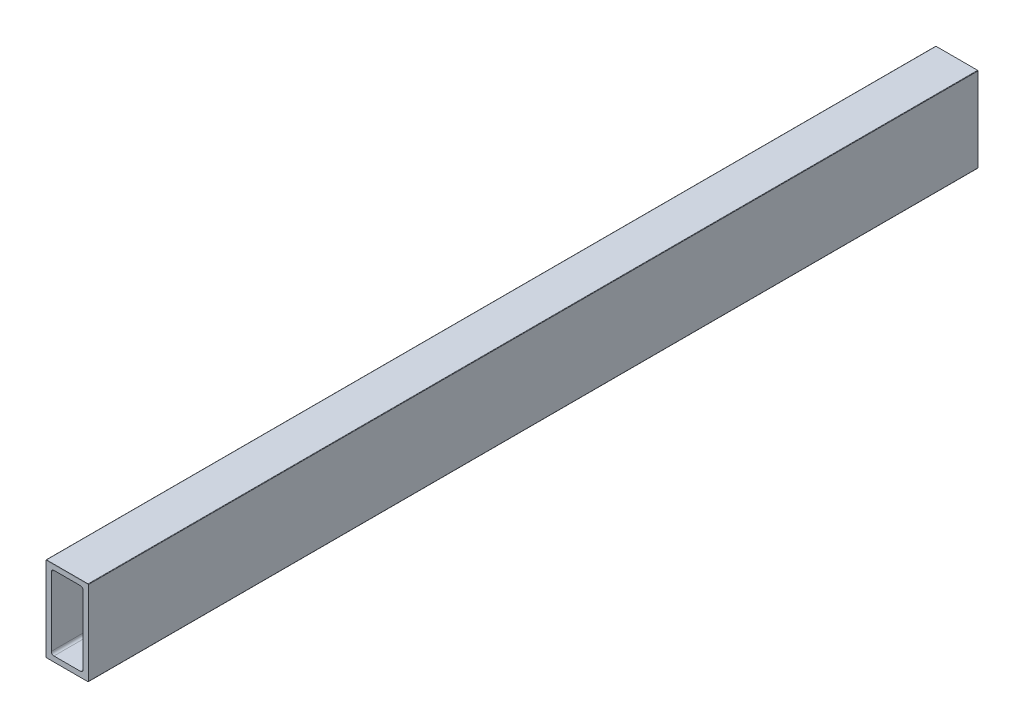
ISO-10303-21;
HEADER;
FILE_DESCRIPTION(('STEP AP214'),'2;1');
FILE_NAME('part.step','',(''),(''),'','','');
FILE_SCHEMA(('AUTOMOTIVE_DESIGN { 1 0 10303 214 1 1 1 1 }'));
ENDSEC;
DATA;
#1=APPLICATION_CONTEXT('core data for automotive mechanical design processes');
#2=APPLICATION_PROTOCOL_DEFINITION('international standard','automotive_design',2000,#1);
#3=PRODUCT_CONTEXT('',#1,'mechanical');
#4=PRODUCT('Part','Part','',(#3));
#5=PRODUCT_RELATED_PRODUCT_CATEGORY('part','',(#4));
#6=PRODUCT_DEFINITION_FORMATION('','',#4);
#7=PRODUCT_DEFINITION_CONTEXT('part definition',#1,'design');
#8=PRODUCT_DEFINITION('design','',#6,#7);
#9=PRODUCT_DEFINITION_SHAPE('','',#8);
#10=(LENGTH_UNIT() NAMED_UNIT(*) SI_UNIT(.MILLI.,.METRE.));
#11=(NAMED_UNIT(*) PLANE_ANGLE_UNIT() SI_UNIT($,.RADIAN.));
#12=(NAMED_UNIT(*) SI_UNIT($,.STERADIAN.) SOLID_ANGLE_UNIT());
#13=UNCERTAINTY_MEASURE_WITH_UNIT(LENGTH_MEASURE(1.E-05),#10,'distance_accuracy_value','');
#14=(GEOMETRIC_REPRESENTATION_CONTEXT(3) GLOBAL_UNCERTAINTY_ASSIGNED_CONTEXT((#13)) GLOBAL_UNIT_ASSIGNED_CONTEXT((#10,
#11,#12)) REPRESENTATION_CONTEXT('',''));
#15=CARTESIAN_POINT('',(0.,0.,0.));
#16=DIRECTION('',(0.,0.,1.));
#17=DIRECTION('',(1.,0.,0.));
#18=AXIS2_PLACEMENT_3D('',#15,#16,#17);
#19=CARTESIAN_POINT('',(3.175,4.7625,1828.8));
#20=DIRECTION('',(1.,0.,0.));
#21=DIRECTION('',(0.,1.,0.));
#22=AXIS2_PLACEMENT_3D('',#19,#20,#21);
#23=PLANE('',#22);
#24=DIRECTION('',(0.,1.,0.));
#25=VECTOR('',#24,1.);
#26=CARTESIAN_POINT('',(3.175,4.7625,533.4));
#27=LINE('',#26,#25);
#28=CARTESIAN_POINT('',(3.175,4.7625,533.4));
#29=VERTEX_POINT('',#28);
#30=CARTESIAN_POINT('',(3.175,46.0375,533.4));
#31=VERTEX_POINT('',#30);
#32=EDGE_CURVE('E306',#29,#31,#27,.T.);
#33=ORIENTED_EDGE('',*,*,#32,.F.);
#34=DIRECTION('',(0.,0.,-1.));
#35=VECTOR('',#34,1.);
#36=CARTESIAN_POINT('',(3.175,4.7625,1828.8));
#37=LINE('',#36,#35);
#38=CARTESIAN_POINT('',(3.175,4.7625,0.));
#39=VERTEX_POINT('',#38);
#40=EDGE_CURVE('E200',#29,#39,#37,.T.);
#41=ORIENTED_EDGE('',*,*,#40,.T.);
#42=DIRECTION('',(0.,-1.,0.));
#43=VECTOR('',#42,1.);
#44=CARTESIAN_POINT('',(3.175,4.7625,0.));
#45=LINE('',#44,#43);
#46=CARTESIAN_POINT('',(3.175,46.0375,0.));
#47=VERTEX_POINT('',#46);
#48=EDGE_CURVE('E226',#47,#39,#45,.T.);
#49=ORIENTED_EDGE('',*,*,#48,.F.);
#50=DIRECTION('',(0.,0.,-1.));
#51=VECTOR('',#50,1.);
#52=CARTESIAN_POINT('',(3.175,46.0375,1828.8));
#53=LINE('',#52,#51);
#54=EDGE_CURVE('E271',#31,#47,#53,.T.);
#55=ORIENTED_EDGE('',*,*,#54,.F.);
#56=EDGE_LOOP('',(#33,#41,#49,#55));
#57=FACE_BOUND('',#56,.T.);
#58=ADVANCED_FACE('F44',(#57),#23,.T.);
#59=CARTESIAN_POINT('',(4.7625,46.0375,1828.8));
#60=DIRECTION('',(0.,0.,-1.));
#61=DIRECTION('',(-1.,0.,0.));
#62=AXIS2_PLACEMENT_3D('',#59,#60,#61);
#63=CYLINDRICAL_SURFACE('',#62,1.5875);
#64=DIRECTION('',(0.,0.,-1.));
#65=VECTOR('',#64,1.);
#66=CARTESIAN_POINT('',(4.7625,47.625,1828.8));
#67=LINE('',#66,#65);
#68=CARTESIAN_POINT('',(4.7625,47.625,533.4));
#69=VERTEX_POINT('',#68);
#70=CARTESIAN_POINT('',(4.7625,47.625,0.));
#71=VERTEX_POINT('',#70);
#72=EDGE_CURVE('E248',#69,#71,#67,.T.);
#73=ORIENTED_EDGE('',*,*,#72,.F.);
#74=CARTESIAN_POINT('',(4.7625,46.0375,533.4));
#75=DIRECTION('',(0.,0.,-1.));
#76=DIRECTION('',(-1.,0.,0.));
#77=AXIS2_PLACEMENT_3D('',#74,#75,#76);
#78=CIRCLE('',#77,1.5875);
#79=EDGE_CURVE('E308',#69,#31,#78,.F.);
#80=ORIENTED_EDGE('',*,*,#79,.T.);
#81=ORIENTED_EDGE('',*,*,#54,.T.);
#82=CARTESIAN_POINT('',(4.7625,46.0375,0.));
#83=DIRECTION('',(0.,0.,1.));
#84=DIRECTION('',(-1.,0.,0.));
#85=AXIS2_PLACEMENT_3D('',#82,#83,#84);
#86=CIRCLE('',#85,1.5875);
#87=EDGE_CURVE('E266',#71,#47,#86,.T.);
#88=ORIENTED_EDGE('',*,*,#87,.F.);
#89=EDGE_LOOP('',(#73,#80,#81,#88));
#90=FACE_BOUND('',#89,.T.);
#91=ADVANCED_FACE('F465',(#90),#63,.F.);
#92=CARTESIAN_POINT('',(4.7625,47.625,1828.8));
#93=DIRECTION('',(0.,-1.,0.));
#94=DIRECTION('',(0.,0.,-1.));
#95=AXIS2_PLACEMENT_3D('',#92,#93,#94);
#96=PLANE('',#95);
#97=DIRECTION('',(1.,0.,0.));
#98=VECTOR('',#97,1.);
#99=CARTESIAN_POINT('',(4.7625,47.625,533.4));
#100=LINE('',#99,#98);
#101=CARTESIAN_POINT('',(20.6375,47.625,533.4));
#102=VERTEX_POINT('',#101);
#103=EDGE_CURVE('E311',#69,#102,#100,.T.);
#104=ORIENTED_EDGE('',*,*,#103,.F.);
#105=ORIENTED_EDGE('',*,*,#72,.T.);
#106=DIRECTION('',(-1.,0.,0.));
#107=VECTOR('',#106,1.);
#108=CARTESIAN_POINT('',(4.7625,47.625,0.));
#109=LINE('',#108,#107);
#110=CARTESIAN_POINT('',(20.6375,47.625,0.));
#111=VERTEX_POINT('',#110);
#112=EDGE_CURVE('E255',#111,#71,#109,.T.);
#113=ORIENTED_EDGE('',*,*,#112,.F.);
#114=DIRECTION('',(0.,0.,-1.));
#115=VECTOR('',#114,1.);
#116=CARTESIAN_POINT('',(20.6375,47.625,1828.8));
#117=LINE('',#116,#115);
#118=EDGE_CURVE('E246',#102,#111,#117,.T.);
#119=ORIENTED_EDGE('',*,*,#118,.F.);
#120=EDGE_LOOP('',(#104,#105,#113,#119));
#121=FACE_BOUND('',#120,.T.);
#122=ADVANCED_FACE('F390',(#121),#96,.T.);
#123=CARTESIAN_POINT('',(20.6375,46.0375,1828.8));
#124=DIRECTION('',(0.,0.,-1.));
#125=DIRECTION('',(-1.,0.,0.));
#126=AXIS2_PLACEMENT_3D('',#123,#124,#125);
#127=CYLINDRICAL_SURFACE('',#126,1.5875);
#128=DIRECTION('',(0.,0.,-1.));
#129=VECTOR('',#128,1.);
#130=CARTESIAN_POINT('',(22.225,46.0375,1828.8));
#131=LINE('',#130,#129);
#132=CARTESIAN_POINT('',(22.225,46.0375,533.4));
#133=VERTEX_POINT('',#132);
#134=CARTESIAN_POINT('',(22.225,46.0375,0.));
#135=VERTEX_POINT('',#134);
#136=EDGE_CURVE('E212',#133,#135,#131,.T.);
#137=ORIENTED_EDGE('',*,*,#136,.F.);
#138=CARTESIAN_POINT('',(20.6375,46.0375,533.4));
#139=DIRECTION('',(0.,0.,-1.));
#140=DIRECTION('',(-1.,0.,0.));
#141=AXIS2_PLACEMENT_3D('',#138,#139,#140);
#142=CIRCLE('',#141,1.5875);
#143=EDGE_CURVE('E313',#133,#102,#142,.F.);
#144=ORIENTED_EDGE('',*,*,#143,.T.);
#145=ORIENTED_EDGE('',*,*,#118,.T.);
#146=CARTESIAN_POINT('',(20.6375,46.0375,0.));
#147=DIRECTION('',(0.,0.,1.));
#148=DIRECTION('',(-1.,0.,0.));
#149=AXIS2_PLACEMENT_3D('',#146,#147,#148);
#150=CIRCLE('',#149,1.5875);
#151=EDGE_CURVE('E224',#135,#111,#150,.T.);
#152=ORIENTED_EDGE('',*,*,#151,.F.);
#153=EDGE_LOOP('',(#137,#144,#145,#152));
#154=FACE_BOUND('',#153,.T.);
#155=ADVANCED_FACE('F385',(#154),#127,.F.);
#156=CARTESIAN_POINT('',(22.225,4.7625,1828.8));
#157=DIRECTION('',(-1.,0.,0.));
#158=DIRECTION('',(0.,0.,1.));
#159=AXIS2_PLACEMENT_3D('',#156,#157,#158);
#160=PLANE('',#159);
#161=DIRECTION('',(0.,-1.,0.));
#162=VECTOR('',#161,1.);
#163=CARTESIAN_POINT('',(22.225,4.7625,533.4));
#164=LINE('',#163,#162);
#165=CARTESIAN_POINT('',(22.225,4.7625,533.4));
#166=VERTEX_POINT('',#165);
#167=EDGE_CURVE('E316',#133,#166,#164,.T.);
#168=ORIENTED_EDGE('',*,*,#167,.F.);
#169=ORIENTED_EDGE('',*,*,#136,.T.);
#170=DIRECTION('',(0.,1.,0.));
#171=VECTOR('',#170,1.);
#172=CARTESIAN_POINT('',(22.225,4.7625,0.));
#173=LINE('',#172,#171);
#174=CARTESIAN_POINT('',(22.225,4.7625,0.));
#175=VERTEX_POINT('',#174);
#176=EDGE_CURVE('E220',#175,#135,#173,.T.);
#177=ORIENTED_EDGE('',*,*,#176,.F.);
#178=DIRECTION('',(0.,0.,-1.));
#179=VECTOR('',#178,1.);
#180=CARTESIAN_POINT('',(22.225,4.7625,1828.8));
#181=LINE('',#180,#179);
#182=EDGE_CURVE('E210',#166,#175,#181,.T.);
#183=ORIENTED_EDGE('',*,*,#182,.F.);
#184=EDGE_LOOP('',(#168,#169,#177,#183));
#185=FACE_BOUND('',#184,.T.);
#186=ADVANCED_FACE('F361',(#185),#160,.T.);
#187=CARTESIAN_POINT('',(20.6375,4.7625,1828.8));
#188=DIRECTION('',(0.,0.,-1.));
#189=DIRECTION('',(-1.,0.,0.));
#190=AXIS2_PLACEMENT_3D('',#187,#188,#189);
#191=CYLINDRICAL_SURFACE('',#190,1.5875);
#192=DIRECTION('',(0.,0.,-1.));
#193=VECTOR('',#192,1.);
#194=CARTESIAN_POINT('',(20.6375,3.175,1828.8));
#195=LINE('',#194,#193);
#196=CARTESIAN_POINT('',(20.6375,3.175,533.4));
#197=VERTEX_POINT('',#196);
#198=CARTESIAN_POINT('',(20.6375,3.175,0.));
#199=VERTEX_POINT('',#198);
#200=EDGE_CURVE('E213',#197,#199,#195,.T.);
#201=ORIENTED_EDGE('',*,*,#200,.F.);
#202=CARTESIAN_POINT('',(20.6375,4.7625,533.4));
#203=DIRECTION('',(0.,0.,-1.));
#204=DIRECTION('',(-1.,0.,0.));
#205=AXIS2_PLACEMENT_3D('',#202,#203,#204);
#206=CIRCLE('',#205,1.5875);
#207=EDGE_CURVE('E318',#197,#166,#206,.F.);
#208=ORIENTED_EDGE('',*,*,#207,.T.);
#209=ORIENTED_EDGE('',*,*,#182,.T.);
#210=CARTESIAN_POINT('',(20.6375,4.7625,0.));
#211=DIRECTION('',(0.,0.,1.));
#212=DIRECTION('',(-1.,0.,0.));
#213=AXIS2_PLACEMENT_3D('',#210,#211,#212);
#214=CIRCLE('',#213,1.5875);
#215=EDGE_CURVE('E225',#199,#175,#214,.T.);
#216=ORIENTED_EDGE('',*,*,#215,.F.);
#217=EDGE_LOOP('',(#201,#208,#209,#216));
#218=FACE_BOUND('',#217,.T.);
#219=ADVANCED_FACE('F355',(#218),#191,.F.);
#220=CARTESIAN_POINT('',(4.7625,3.175,1828.8));
#221=DIRECTION('',(0.,1.,0.));
#222=DIRECTION('',(1.,0.,0.));
#223=AXIS2_PLACEMENT_3D('',#220,#221,#222);
#224=PLANE('',#223);
#225=DIRECTION('',(-1.,0.,0.));
#226=VECTOR('',#225,1.);
#227=CARTESIAN_POINT('',(4.7625,3.175,533.4));
#228=LINE('',#227,#226);
#229=CARTESIAN_POINT('',(4.7625,3.175,533.4));
#230=VERTEX_POINT('',#229);
#231=EDGE_CURVE('E59',#197,#230,#228,.T.);
#232=ORIENTED_EDGE('',*,*,#231,.F.);
#233=ORIENTED_EDGE('',*,*,#200,.T.);
#234=DIRECTION('',(1.,0.,0.));
#235=VECTOR('',#234,1.);
#236=CARTESIAN_POINT('',(4.7625,3.175,0.));
#237=LINE('',#236,#235);
#238=CARTESIAN_POINT('',(4.7625,3.175,0.));
#239=VERTEX_POINT('',#238);
#240=EDGE_CURVE('E262',#239,#199,#237,.T.);
#241=ORIENTED_EDGE('',*,*,#240,.F.);
#242=DIRECTION('',(0.,0.,-1.));
#243=VECTOR('',#242,1.);
#244=CARTESIAN_POINT('',(4.7625,3.175,1828.8));
#245=LINE('',#244,#243);
#246=EDGE_CURVE('E203',#230,#239,#245,.T.);
#247=ORIENTED_EDGE('',*,*,#246,.F.);
#248=EDGE_LOOP('',(#232,#233,#241,#247));
#249=FACE_BOUND('',#248,.T.);
#250=ADVANCED_FACE('F360',(#249),#224,.T.);
#251=CARTESIAN_POINT('',(4.7625,4.7625,1828.8));
#252=DIRECTION('',(0.,0.,-1.));
#253=DIRECTION('',(-1.,0.,0.));
#254=AXIS2_PLACEMENT_3D('',#251,#252,#253);
#255=CYLINDRICAL_SURFACE('',#254,1.5875);
#256=ORIENTED_EDGE('',*,*,#40,.F.);
#257=CARTESIAN_POINT('',(4.7625,4.7625,533.4));
#258=DIRECTION('',(0.,0.,-1.));
#259=DIRECTION('',(-1.,0.,0.));
#260=AXIS2_PLACEMENT_3D('',#257,#258,#259);
#261=CIRCLE('',#260,1.5875);
#262=EDGE_CURVE('E322',#29,#230,#261,.F.);
#263=ORIENTED_EDGE('',*,*,#262,.T.);
#264=ORIENTED_EDGE('',*,*,#246,.T.);
#265=CARTESIAN_POINT('',(4.7625,4.7625,0.));
#266=DIRECTION('',(0.,0.,1.));
#267=DIRECTION('',(1.,0.,0.));
#268=AXIS2_PLACEMENT_3D('',#265,#266,#267);
#269=CIRCLE('',#268,1.5875);
#270=EDGE_CURVE('E230',#39,#239,#269,.T.);
#271=ORIENTED_EDGE('',*,*,#270,.F.);
#272=EDGE_LOOP('',(#256,#263,#264,#271));
#273=FACE_BOUND('',#272,.T.);
#274=ADVANCED_FACE('F431',(#273),#255,.F.);
#275=CARTESIAN_POINT('',(0.,0.254,1828.8));
#276=DIRECTION('',(1.,0.,0.));
#277=DIRECTION('',(0.,1.,0.));
#278=AXIS2_PLACEMENT_3D('',#275,#276,#277);
#279=PLANE('',#278);
#280=DIRECTION('',(0.,0.,-1.));
#281=VECTOR('',#280,1.);
#282=CARTESIAN_POINT('',(0.,0.254,1828.8));
#283=LINE('',#282,#281);
#284=CARTESIAN_POINT('',(0.,0.254,533.4));
#285=VERTEX_POINT('',#284);
#286=CARTESIAN_POINT('',(0.,0.254,0.));
#287=VERTEX_POINT('',#286);
#288=EDGE_CURVE('E194',#285,#287,#283,.T.);
#289=ORIENTED_EDGE('',*,*,#288,.F.);
#290=DIRECTION('',(0.,-1.,0.));
#291=VECTOR('',#290,1.);
#292=CARTESIAN_POINT('',(0.,-78.7444375081889,533.4));
#293=LINE('',#292,#291);
#294=CARTESIAN_POINT('',(0.,50.546,533.4));
#295=VERTEX_POINT('',#294);
#296=EDGE_CURVE('E67',#295,#285,#293,.T.);
#297=ORIENTED_EDGE('',*,*,#296,.F.);
#298=DIRECTION('',(0.,0.,-1.));
#299=VECTOR('',#298,1.);
#300=CARTESIAN_POINT('',(0.,50.546,1828.8));
#301=LINE('',#300,#299);
#302=CARTESIAN_POINT('',(0.,50.546,0.));
#303=VERTEX_POINT('',#302);
#304=EDGE_CURVE('E192',#295,#303,#301,.T.);
#305=ORIENTED_EDGE('',*,*,#304,.T.);
#306=DIRECTION('',(0.,-1.,0.));
#307=VECTOR('',#306,1.);
#308=CARTESIAN_POINT('',(0.,0.254,0.));
#309=LINE('',#308,#307);
#310=EDGE_CURVE('E256',#303,#287,#309,.T.);
#311=ORIENTED_EDGE('',*,*,#310,.T.);
#312=EDGE_LOOP('',(#289,#297,#305,#311));
#313=FACE_BOUND('',#312,.T.);
#314=ADVANCED_FACE('F46',(#313),#279,.F.);
#315=CARTESIAN_POINT('',(0.254,50.546,1828.8));
#316=DIRECTION('',(0.,0.,-1.));
#317=DIRECTION('',(-1.,0.,0.));
#318=AXIS2_PLACEMENT_3D('',#315,#316,#317);
#319=CYLINDRICAL_SURFACE('',#318,0.253999999999995);
#320=CARTESIAN_POINT('',(0.254,50.546,533.4));
#321=DIRECTION('',(0.,-0.160026046570858,-0.987112792146319));
#322=DIRECTION('',(0.,0.987112792146319,-0.160026046570858));
#323=AXIS2_PLACEMENT_3D('',#320,#321,#322);
#324=ELLIPSE('',#323,0.257316085882863,0.253999999999995);
#325=CARTESIAN_POINT('',(0.254,50.8,533.358822724057));
#326=VERTEX_POINT('',#325);
#327=EDGE_CURVE('E173',#326,#295,#324,.F.);
#328=ORIENTED_EDGE('',*,*,#327,.F.);
#329=DIRECTION('',(0.,0.,-1.));
#330=VECTOR('',#329,1.);
#331=CARTESIAN_POINT('',(0.254,50.8,1828.8));
#332=LINE('',#331,#330);
#333=CARTESIAN_POINT('',(0.254,50.8,0.));
#334=VERTEX_POINT('',#333);
#335=EDGE_CURVE('E201',#326,#334,#332,.T.);
#336=ORIENTED_EDGE('',*,*,#335,.T.);
#337=CARTESIAN_POINT('',(0.254,50.546,0.));
#338=DIRECTION('',(0.,0.,1.));
#339=DIRECTION('',(-1.,0.,0.));
#340=AXIS2_PLACEMENT_3D('',#337,#338,#339);
#341=CIRCLE('',#340,0.253999999999995);
#342=EDGE_CURVE('E198',#334,#303,#341,.T.);
#343=ORIENTED_EDGE('',*,*,#342,.T.);
#344=ORIENTED_EDGE('',*,*,#304,.F.);
#345=EDGE_LOOP('',(#328,#336,#343,#344));
#346=FACE_BOUND('',#345,.T.);
#347=ADVANCED_FACE('F196',(#346),#319,.T.);
#348=CARTESIAN_POINT('',(0.254,50.8,1828.8));
#349=DIRECTION('',(0.,-1.,0.));
#350=DIRECTION('',(0.,0.,-1.));
#351=AXIS2_PLACEMENT_3D('',#348,#349,#350);
#352=PLANE('',#351);
#353=ORIENTED_EDGE('',*,*,#335,.F.);
#354=DIRECTION('',(1.,0.,0.));
#355=VECTOR('',#354,1.);
#356=CARTESIAN_POINT('',(0.254,50.8,533.358822724057));
#357=LINE('',#356,#355);
#358=CARTESIAN_POINT('',(25.146,50.8,533.358822724057));
#359=VERTEX_POINT('',#358);
#360=EDGE_CURVE('E178',#326,#359,#357,.T.);
#361=ORIENTED_EDGE('',*,*,#360,.T.);
#362=DIRECTION('',(0.,0.,-1.));
#363=VECTOR('',#362,1.);
#364=CARTESIAN_POINT('',(25.146,50.8,1828.8));
#365=LINE('',#364,#363);
#366=CARTESIAN_POINT('',(25.146,50.8,0.));
#367=VERTEX_POINT('',#366);
#368=EDGE_CURVE('E205',#359,#367,#365,.T.);
#369=ORIENTED_EDGE('',*,*,#368,.T.);
#370=DIRECTION('',(-1.,0.,0.));
#371=VECTOR('',#370,1.);
#372=CARTESIAN_POINT('',(0.254,50.8,0.));
#373=LINE('',#372,#371);
#374=EDGE_CURVE('E231',#367,#334,#373,.T.);
#375=ORIENTED_EDGE('',*,*,#374,.T.);
#376=EDGE_LOOP('',(#353,#361,#369,#375));
#377=FACE_BOUND('',#376,.T.);
#378=ADVANCED_FACE('F340',(#377),#352,.F.);
#379=CARTESIAN_POINT('',(25.146,50.546,1828.8));
#380=DIRECTION('',(0.,0.,-1.));
#381=DIRECTION('',(-1.,0.,0.));
#382=AXIS2_PLACEMENT_3D('',#379,#380,#381);
#383=CYLINDRICAL_SURFACE('',#382,0.253999999999994);
#384=CARTESIAN_POINT('',(25.146,50.546,533.4));
#385=DIRECTION('',(0.,-0.160026046570858,-0.987112792146319));
#386=DIRECTION('',(0.,0.987112792146319,-0.160026046570858));
#387=AXIS2_PLACEMENT_3D('',#384,#385,#386);
#388=ELLIPSE('',#387,0.257316085882862,0.253999999999994);
#389=CARTESIAN_POINT('',(25.4,50.546,533.4));
#390=VERTEX_POINT('',#389);
#391=EDGE_CURVE('E11',#390,#359,#388,.F.);
#392=ORIENTED_EDGE('',*,*,#391,.F.);
#393=DIRECTION('',(0.,0.,-1.));
#394=VECTOR('',#393,1.);
#395=CARTESIAN_POINT('',(25.4,50.546,1828.8));
#396=LINE('',#395,#394);
#397=CARTESIAN_POINT('',(25.4,50.546,0.));
#398=VERTEX_POINT('',#397);
#399=EDGE_CURVE('E244',#390,#398,#396,.T.);
#400=ORIENTED_EDGE('',*,*,#399,.T.);
#401=CARTESIAN_POINT('',(25.146,50.546,0.));
#402=DIRECTION('',(0.,0.,1.));
#403=DIRECTION('',(-1.,0.,0.));
#404=AXIS2_PLACEMENT_3D('',#401,#402,#403);
#405=CIRCLE('',#404,0.253999999999994);
#406=EDGE_CURVE('E234',#398,#367,#405,.T.);
#407=ORIENTED_EDGE('',*,*,#406,.T.);
#408=ORIENTED_EDGE('',*,*,#368,.F.);
#409=EDGE_LOOP('',(#392,#400,#407,#408));
#410=FACE_BOUND('',#409,.T.);
#411=ADVANCED_FACE('F338',(#410),#383,.T.);
#412=CARTESIAN_POINT('',(25.4,0.254,1828.8));
#413=DIRECTION('',(-1.,0.,0.));
#414=DIRECTION('',(0.,0.,1.));
#415=AXIS2_PLACEMENT_3D('',#412,#413,#414);
#416=PLANE('',#415);
#417=ORIENTED_EDGE('',*,*,#399,.F.);
#418=DIRECTION('',(0.,-1.,0.));
#419=VECTOR('',#418,1.);
#420=CARTESIAN_POINT('',(25.4,0.254,533.4));
#421=LINE('',#420,#419);
#422=CARTESIAN_POINT('',(25.4,0.254,533.4));
#423=VERTEX_POINT('',#422);
#424=EDGE_CURVE('E186',#390,#423,#421,.T.);
#425=ORIENTED_EDGE('',*,*,#424,.T.);
#426=DIRECTION('',(0.,0.,-1.));
#427=VECTOR('',#426,1.);
#428=CARTESIAN_POINT('',(25.4,0.254,1828.8));
#429=LINE('',#428,#427);
#430=CARTESIAN_POINT('',(25.4,0.254,0.));
#431=VERTEX_POINT('',#430);
#432=EDGE_CURVE('E242',#423,#431,#429,.T.);
#433=ORIENTED_EDGE('',*,*,#432,.T.);
#434=DIRECTION('',(0.,1.,0.));
#435=VECTOR('',#434,1.);
#436=CARTESIAN_POINT('',(25.4,0.254,0.));
#437=LINE('',#436,#435);
#438=EDGE_CURVE('E219',#431,#398,#437,.T.);
#439=ORIENTED_EDGE('',*,*,#438,.T.);
#440=EDGE_LOOP('',(#417,#425,#433,#439));
#441=FACE_BOUND('',#440,.T.);
#442=ADVANCED_FACE('F329',(#441),#416,.F.);
#443=CARTESIAN_POINT('',(25.146,0.254,1828.8));
#444=DIRECTION('',(0.,0.,-1.));
#445=DIRECTION('',(-1.,0.,0.));
#446=AXIS2_PLACEMENT_3D('',#443,#444,#445);
#447=CYLINDRICAL_SURFACE('',#446,0.254);
#448=CARTESIAN_POINT('',(25.146,0.254,533.4));
#449=DIRECTION('',(0.,0.,-1.));
#450=DIRECTION('',(-1.,0.,0.));
#451=AXIS2_PLACEMENT_3D('',#448,#449,#450);
#452=CIRCLE('',#451,0.254);
#453=CARTESIAN_POINT('',(25.146,0.,533.4));
#454=VERTEX_POINT('',#453);
#455=EDGE_CURVE('E286',#454,#423,#452,.F.);
#456=ORIENTED_EDGE('',*,*,#455,.F.);
#457=DIRECTION('',(0.,0.,-1.));
#458=VECTOR('',#457,1.);
#459=CARTESIAN_POINT('',(25.146,0.,1828.8));
#460=LINE('',#459,#458);
#461=CARTESIAN_POINT('',(25.146,0.,0.));
#462=VERTEX_POINT('',#461);
#463=EDGE_CURVE('E240',#454,#462,#460,.T.);
#464=ORIENTED_EDGE('',*,*,#463,.T.);
#465=CARTESIAN_POINT('',(25.146,0.254,0.));
#466=DIRECTION('',(0.,0.,1.));
#467=DIRECTION('',(1.,0.,0.));
#468=AXIS2_PLACEMENT_3D('',#465,#466,#467);
#469=CIRCLE('',#468,0.254);
#470=EDGE_CURVE('E214',#462,#431,#469,.T.);
#471=ORIENTED_EDGE('',*,*,#470,.T.);
#472=ORIENTED_EDGE('',*,*,#432,.F.);
#473=EDGE_LOOP('',(#456,#464,#471,#472));
#474=FACE_BOUND('',#473,.T.);
#475=ADVANCED_FACE('F330',(#474),#447,.T.);
#476=CARTESIAN_POINT('',(0.254,0.,1828.8));
#477=DIRECTION('',(0.,1.,0.));
#478=DIRECTION('',(1.,0.,0.));
#479=AXIS2_PLACEMENT_3D('',#476,#477,#478);
#480=PLANE('',#479);
#481=ORIENTED_EDGE('',*,*,#463,.F.);
#482=DIRECTION('',(-1.,0.,0.));
#483=VECTOR('',#482,1.);
#484=CARTESIAN_POINT('',(0.254,0.,533.4));
#485=LINE('',#484,#483);
#486=CARTESIAN_POINT('',(0.254,0.,533.4));
#487=VERTEX_POINT('',#486);
#488=EDGE_CURVE('E187',#454,#487,#485,.T.);
#489=ORIENTED_EDGE('',*,*,#488,.T.);
#490=DIRECTION('',(0.,0.,-1.));
#491=VECTOR('',#490,1.);
#492=CARTESIAN_POINT('',(0.254,0.,1828.8));
#493=LINE('',#492,#491);
#494=CARTESIAN_POINT('',(0.254,0.,0.));
#495=VERTEX_POINT('',#494);
#496=EDGE_CURVE('E265',#487,#495,#493,.T.);
#497=ORIENTED_EDGE('',*,*,#496,.T.);
#498=DIRECTION('',(1.,0.,0.));
#499=VECTOR('',#498,1.);
#500=CARTESIAN_POINT('',(0.254,0.,0.));
#501=LINE('',#500,#499);
#502=EDGE_CURVE('E218',#495,#462,#501,.T.);
#503=ORIENTED_EDGE('',*,*,#502,.T.);
#504=EDGE_LOOP('',(#481,#489,#497,#503));
#505=FACE_BOUND('',#504,.T.);
#506=ADVANCED_FACE('F284',(#505),#480,.F.);
#507=CARTESIAN_POINT('',(0.254,0.254,1828.8));
#508=DIRECTION('',(0.,0.,-1.));
#509=DIRECTION('',(-1.,0.,0.));
#510=AXIS2_PLACEMENT_3D('',#507,#508,#509);
#511=CYLINDRICAL_SURFACE('',#510,0.254);
#512=CARTESIAN_POINT('',(0.254,0.254,533.4));
#513=DIRECTION('',(0.,0.,-1.));
#514=DIRECTION('',(-1.,0.,0.));
#515=AXIS2_PLACEMENT_3D('',#512,#513,#514);
#516=CIRCLE('',#515,0.254);
#517=EDGE_CURVE('E52',#285,#487,#516,.F.);
#518=ORIENTED_EDGE('',*,*,#517,.F.);
#519=ORIENTED_EDGE('',*,*,#288,.T.);
#520=CARTESIAN_POINT('',(0.254,0.254,0.));
#521=DIRECTION('',(0.,0.,1.));
#522=DIRECTION('',(-1.,0.,0.));
#523=AXIS2_PLACEMENT_3D('',#520,#521,#522);
#524=CIRCLE('',#523,0.254);
#525=EDGE_CURVE('E182',#287,#495,#524,.T.);
#526=ORIENTED_EDGE('',*,*,#525,.T.);
#527=ORIENTED_EDGE('',*,*,#496,.F.);
#528=EDGE_LOOP('',(#518,#519,#526,#527));
#529=FACE_BOUND('',#528,.T.);
#530=ADVANCED_FACE('F289',(#529),#511,.T.);
#531=CARTESIAN_POINT('',(0.254,0.254,0.));
#532=DIRECTION('',(0.,0.,-1.));
#533=DIRECTION('',(0.,-1.,0.));
#534=AXIS2_PLACEMENT_3D('',#531,#532,#533);
#535=PLANE('',#534);
#536=ORIENTED_EDGE('',*,*,#48,.T.);
#537=ORIENTED_EDGE('',*,*,#270,.T.);
#538=ORIENTED_EDGE('',*,*,#240,.T.);
#539=ORIENTED_EDGE('',*,*,#215,.T.);
#540=ORIENTED_EDGE('',*,*,#176,.T.);
#541=ORIENTED_EDGE('',*,*,#151,.T.);
#542=ORIENTED_EDGE('',*,*,#112,.T.);
#543=ORIENTED_EDGE('',*,*,#87,.T.);
#544=EDGE_LOOP('',(#536,#537,#538,#539,#540,#541,#542,#543));
#545=FACE_BOUND('',#544,.T.);
#546=ORIENTED_EDGE('',*,*,#525,.F.);
#547=ORIENTED_EDGE('',*,*,#310,.F.);
#548=ORIENTED_EDGE('',*,*,#342,.F.);
#549=ORIENTED_EDGE('',*,*,#374,.F.);
#550=ORIENTED_EDGE('',*,*,#406,.F.);
#551=ORIENTED_EDGE('',*,*,#438,.F.);
#552=ORIENTED_EDGE('',*,*,#470,.F.);
#553=ORIENTED_EDGE('',*,*,#502,.F.);
#554=EDGE_LOOP('',(#546,#547,#548,#549,#550,#551,#552,#553));
#555=FACE_BOUND('',#554,.T.);
#556=ADVANCED_FACE('F334',(#545,#555),#535,.T.);
#557=CARTESIAN_POINT('',(58.166,-78.7444375081889,533.4));
#558=DIRECTION('',(0.,0.,-1.));
#559=DIRECTION('',(-1.,0.,0.));
#560=AXIS2_PLACEMENT_3D('',#557,#558,#559);
#561=PLANE('',#560);
#562=ORIENTED_EDGE('',*,*,#32,.T.);
#563=ORIENTED_EDGE('',*,*,#79,.F.);
#564=ORIENTED_EDGE('',*,*,#103,.T.);
#565=ORIENTED_EDGE('',*,*,#143,.F.);
#566=ORIENTED_EDGE('',*,*,#167,.T.);
#567=ORIENTED_EDGE('',*,*,#207,.F.);
#568=ORIENTED_EDGE('',*,*,#231,.T.);
#569=ORIENTED_EDGE('',*,*,#262,.F.);
#570=EDGE_LOOP('',(#562,#563,#564,#565,#566,#567,#568,#569));
#571=FACE_BOUND('',#570,.T.);
#572=DIRECTION('',(-1.,0.,0.));
#573=VECTOR('',#572,1.);
#574=CARTESIAN_POINT('',(58.166,50.546,533.4));
#575=LINE('',#574,#573);
#576=EDGE_CURVE('E175',#390,#295,#575,.T.);
#577=ORIENTED_EDGE('',*,*,#576,.T.);
#578=ORIENTED_EDGE('',*,*,#296,.T.);
#579=ORIENTED_EDGE('',*,*,#517,.T.);
#580=ORIENTED_EDGE('',*,*,#488,.F.);
#581=ORIENTED_EDGE('',*,*,#455,.T.);
#582=ORIENTED_EDGE('',*,*,#424,.F.);
#583=EDGE_LOOP('',(#577,#578,#579,#580,#581,#582));
#584=FACE_BOUND('',#583,.T.);
#585=ADVANCED_FACE('F184',(#571,#584),#561,.F.);
#586=CARTESIAN_POINT('',(58.166,50.546,533.4));
#587=DIRECTION('',(0.,-0.160026046570858,-0.987112792146319));
#588=DIRECTION('',(0.,0.987112792146319,-0.160026046570858));
#589=AXIS2_PLACEMENT_3D('',#586,#587,#588);
#590=PLANE('',#589);
#591=ORIENTED_EDGE('',*,*,#327,.T.);
#592=ORIENTED_EDGE('',*,*,#576,.F.);
#593=ORIENTED_EDGE('',*,*,#391,.T.);
#594=ORIENTED_EDGE('',*,*,#360,.F.);
#595=EDGE_LOOP('',(#591,#592,#593,#594));
#596=FACE_BOUND('',#595,.T.);
#597=ADVANCED_FACE('F174',(#596),#590,.F.);
#598=CLOSED_SHELL('',(#58,#91,#122,#155,#186,#219,#250,#274,#314,#347,#378,#411,#442,#475,#506,
#530,#556,#585,#597));
#599=MANIFOLD_SOLID_BREP('B2',#598);
#600=ADVANCED_BREP_SHAPE_REPRESENTATION('',(#18,#599),#14);
#601=SHAPE_DEFINITION_REPRESENTATION(#9,#600);
ENDSEC;
END-ISO-10303-21;
